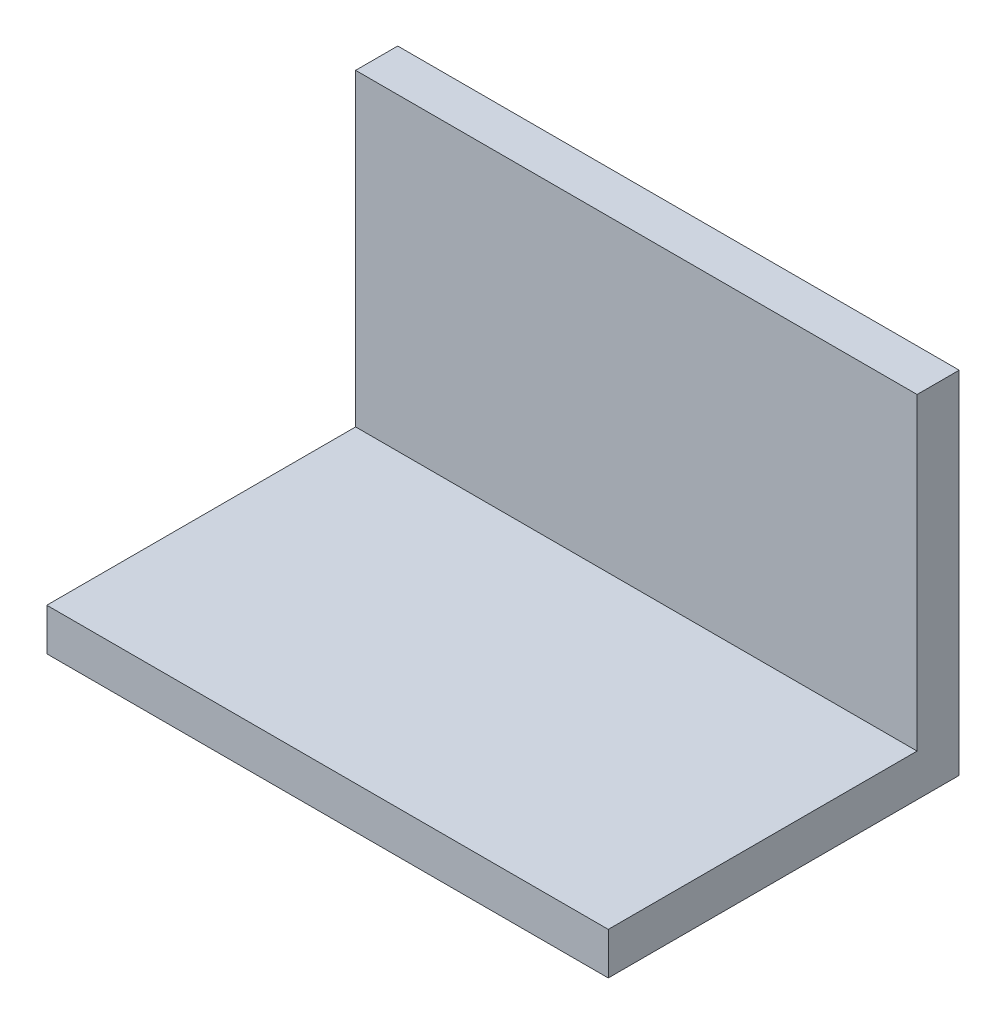
ISO-10303-21;
HEADER;
FILE_DESCRIPTION(('STEP AP214'),'2;1');
FILE_NAME('part.step','',(''),(''),'','','');
FILE_SCHEMA(('AUTOMOTIVE_DESIGN { 1 0 10303 214 1 1 1 1 }'));
ENDSEC;
DATA;
#1=APPLICATION_CONTEXT('core data for automotive mechanical design processes');
#2=APPLICATION_PROTOCOL_DEFINITION('international standard','automotive_design',2000,#1);
#3=PRODUCT_CONTEXT('',#1,'mechanical');
#4=PRODUCT('Part','Part','',(#3));
#5=PRODUCT_RELATED_PRODUCT_CATEGORY('part','',(#4));
#6=PRODUCT_DEFINITION_FORMATION('','',#4);
#7=PRODUCT_DEFINITION_CONTEXT('part definition',#1,'design');
#8=PRODUCT_DEFINITION('design','',#6,#7);
#9=PRODUCT_DEFINITION_SHAPE('','',#8);
#10=(LENGTH_UNIT() NAMED_UNIT(*) SI_UNIT(.MILLI.,.METRE.));
#11=(NAMED_UNIT(*) PLANE_ANGLE_UNIT() SI_UNIT($,.RADIAN.));
#12=(NAMED_UNIT(*) SI_UNIT($,.STERADIAN.) SOLID_ANGLE_UNIT());
#13=UNCERTAINTY_MEASURE_WITH_UNIT(LENGTH_MEASURE(1.E-05),#10,'distance_accuracy_value','');
#14=(GEOMETRIC_REPRESENTATION_CONTEXT(3) GLOBAL_UNCERTAINTY_ASSIGNED_CONTEXT((#13)) GLOBAL_UNIT_ASSIGNED_CONTEXT((#10,
#11,#12)) REPRESENTATION_CONTEXT('',''));
#15=CARTESIAN_POINT('',(0.,0.,0.));
#16=DIRECTION('',(0.,0.,1.));
#17=DIRECTION('',(1.,0.,0.));
#18=AXIS2_PLACEMENT_3D('',#15,#16,#17);
#19=CARTESIAN_POINT('',(0.,6.,0.));
#20=DIRECTION('',(0.,-1.,0.));
#21=DIRECTION('',(0.,0.,-1.));
#22=AXIS2_PLACEMENT_3D('',#19,#20,#21);
#23=PLANE('',#22);
#24=DIRECTION('',(1.,0.,0.));
#25=VECTOR('',#24,1.);
#26=CARTESIAN_POINT('',(-40.,6.,-19.));
#27=LINE('',#26,#25);
#28=CARTESIAN_POINT('',(-40.,6.,-19.));
#29=VERTEX_POINT('',#28);
#30=CARTESIAN_POINT('',(40.,6.,-19.));
#31=VERTEX_POINT('',#30);
#32=EDGE_CURVE('E50',#29,#31,#27,.T.);
#33=ORIENTED_EDGE('',*,*,#32,.F.);
#34=DIRECTION('',(0.,0.,1.));
#35=VECTOR('',#34,1.);
#36=CARTESIAN_POINT('',(-40.,6.,25.));
#37=LINE('',#36,#35);
#38=CARTESIAN_POINT('',(-40.,6.,25.));
#39=VERTEX_POINT('',#38);
#40=EDGE_CURVE('E110',#29,#39,#37,.T.);
#41=ORIENTED_EDGE('',*,*,#40,.T.);
#42=DIRECTION('',(1.,0.,0.));
#43=VECTOR('',#42,1.);
#44=CARTESIAN_POINT('',(-40.,6.,25.));
#45=LINE('',#44,#43);
#46=CARTESIAN_POINT('',(40.,6.,25.));
#47=VERTEX_POINT('',#46);
#48=EDGE_CURVE('E56',#39,#47,#45,.T.);
#49=ORIENTED_EDGE('',*,*,#48,.T.);
#50=DIRECTION('',(0.,0.,-1.));
#51=VECTOR('',#50,1.);
#52=CARTESIAN_POINT('',(40.,6.,25.));
#53=LINE('',#52,#51);
#54=EDGE_CURVE('E85',#47,#31,#53,.T.);
#55=ORIENTED_EDGE('',*,*,#54,.T.);
#56=EDGE_LOOP('',(#33,#41,#49,#55));
#57=FACE_BOUND('',#56,.T.);
#58=ADVANCED_FACE('F33',(#57),#23,.F.);
#59=CARTESIAN_POINT('',(40.,6.,25.));
#60=DIRECTION('',(-1.,0.,0.));
#61=DIRECTION('',(0.,0.,1.));
#62=AXIS2_PLACEMENT_3D('',#59,#60,#61);
#63=PLANE('',#62);
#64=DIRECTION('',(0.,0.,-1.));
#65=VECTOR('',#64,1.);
#66=CARTESIAN_POINT('',(40.,0.,25.));
#67=LINE('',#66,#65);
#68=CARTESIAN_POINT('',(40.,0.,25.));
#69=VERTEX_POINT('',#68);
#70=CARTESIAN_POINT('',(40.,0.,-25.));
#71=VERTEX_POINT('',#70);
#72=EDGE_CURVE('E91',#69,#71,#67,.T.);
#73=ORIENTED_EDGE('',*,*,#72,.T.);
#74=DIRECTION('',(0.,-1.,0.));
#75=VECTOR('',#74,1.);
#76=CARTESIAN_POINT('',(40.,6.,-25.));
#77=LINE('',#76,#75);
#78=CARTESIAN_POINT('',(40.,50.,-25.));
#79=VERTEX_POINT('',#78);
#80=EDGE_CURVE('E11',#79,#71,#77,.T.);
#81=ORIENTED_EDGE('',*,*,#80,.F.);
#82=DIRECTION('',(0.,0.,-1.));
#83=VECTOR('',#82,1.);
#84=CARTESIAN_POINT('',(40.,50.,-19.));
#85=LINE('',#84,#83);
#86=CARTESIAN_POINT('',(40.,50.,-19.));
#87=VERTEX_POINT('',#86);
#88=EDGE_CURVE('E127',#87,#79,#85,.T.);
#89=ORIENTED_EDGE('',*,*,#88,.F.);
#90=DIRECTION('',(0.,-1.,0.));
#91=VECTOR('',#90,1.);
#92=CARTESIAN_POINT('',(40.,50.,-19.));
#93=LINE('',#92,#91);
#94=EDGE_CURVE('E100',#87,#31,#93,.T.);
#95=ORIENTED_EDGE('',*,*,#94,.T.);
#96=ORIENTED_EDGE('',*,*,#54,.F.);
#97=DIRECTION('',(0.,-1.,0.));
#98=VECTOR('',#97,1.);
#99=CARTESIAN_POINT('',(40.,6.,25.));
#100=LINE('',#99,#98);
#101=EDGE_CURVE('E78',#47,#69,#100,.T.);
#102=ORIENTED_EDGE('',*,*,#101,.T.);
#103=EDGE_LOOP('',(#73,#81,#89,#95,#96,#102));
#104=FACE_BOUND('',#103,.T.);
#105=ADVANCED_FACE('F35',(#104),#63,.F.);
#106=CARTESIAN_POINT('',(-40.,6.,-25.));
#107=DIRECTION('',(0.,0.,1.));
#108=DIRECTION('',(1.,0.,0.));
#109=AXIS2_PLACEMENT_3D('',#106,#107,#108);
#110=PLANE('',#109);
#111=DIRECTION('',(-1.,0.,0.));
#112=VECTOR('',#111,1.);
#113=CARTESIAN_POINT('',(-40.,0.,-25.));
#114=LINE('',#113,#112);
#115=CARTESIAN_POINT('',(-40.,0.,-25.));
#116=VERTEX_POINT('',#115);
#117=EDGE_CURVE('E95',#71,#116,#114,.T.);
#118=ORIENTED_EDGE('',*,*,#117,.T.);
#119=DIRECTION('',(0.,-1.,0.));
#120=VECTOR('',#119,1.);
#121=CARTESIAN_POINT('',(-40.,6.,-25.));
#122=LINE('',#121,#120);
#123=CARTESIAN_POINT('',(-40.,50.,-25.));
#124=VERTEX_POINT('',#123);
#125=EDGE_CURVE('E42',#124,#116,#122,.T.);
#126=ORIENTED_EDGE('',*,*,#125,.F.);
#127=DIRECTION('',(-1.,0.,0.));
#128=VECTOR('',#127,1.);
#129=CARTESIAN_POINT('',(-40.,50.,-25.));
#130=LINE('',#129,#128);
#131=EDGE_CURVE('E117',#79,#124,#130,.T.);
#132=ORIENTED_EDGE('',*,*,#131,.F.);
#133=ORIENTED_EDGE('',*,*,#80,.T.);
#134=EDGE_LOOP('',(#118,#126,#132,#133));
#135=FACE_BOUND('',#134,.T.);
#136=ADVANCED_FACE('F151',(#135),#110,.F.);
#137=CARTESIAN_POINT('',(-40.,6.,25.));
#138=DIRECTION('',(1.,0.,0.));
#139=DIRECTION('',(0.,0.,-1.));
#140=AXIS2_PLACEMENT_3D('',#137,#138,#139);
#141=PLANE('',#140);
#142=DIRECTION('',(0.,0.,1.));
#143=VECTOR('',#142,1.);
#144=CARTESIAN_POINT('',(-40.,0.,25.));
#145=LINE('',#144,#143);
#146=CARTESIAN_POINT('',(-40.,0.,25.));
#147=VERTEX_POINT('',#146);
#148=EDGE_CURVE('E86',#116,#147,#145,.T.);
#149=ORIENTED_EDGE('',*,*,#148,.T.);
#150=DIRECTION('',(0.,-1.,0.));
#151=VECTOR('',#150,1.);
#152=CARTESIAN_POINT('',(-40.,6.,25.));
#153=LINE('',#152,#151);
#154=EDGE_CURVE('E81',#39,#147,#153,.T.);
#155=ORIENTED_EDGE('',*,*,#154,.F.);
#156=ORIENTED_EDGE('',*,*,#40,.F.);
#157=DIRECTION('',(0.,-1.,0.));
#158=VECTOR('',#157,1.);
#159=CARTESIAN_POINT('',(-40.,50.,-19.));
#160=LINE('',#159,#158);
#161=CARTESIAN_POINT('',(-40.,50.,-19.));
#162=VERTEX_POINT('',#161);
#163=EDGE_CURVE('E96',#162,#29,#160,.T.);
#164=ORIENTED_EDGE('',*,*,#163,.F.);
#165=DIRECTION('',(0.,0.,1.));
#166=VECTOR('',#165,1.);
#167=CARTESIAN_POINT('',(-40.,50.,-19.));
#168=LINE('',#167,#166);
#169=EDGE_CURVE('E120',#124,#162,#168,.T.);
#170=ORIENTED_EDGE('',*,*,#169,.F.);
#171=ORIENTED_EDGE('',*,*,#125,.T.);
#172=EDGE_LOOP('',(#149,#155,#156,#164,#170,#171));
#173=FACE_BOUND('',#172,.T.);
#174=ADVANCED_FACE('F145',(#173),#141,.F.);
#175=CARTESIAN_POINT('',(-40.,6.,25.));
#176=DIRECTION('',(0.,0.,-1.));
#177=DIRECTION('',(-1.,0.,0.));
#178=AXIS2_PLACEMENT_3D('',#175,#176,#177);
#179=PLANE('',#178);
#180=DIRECTION('',(1.,0.,0.));
#181=VECTOR('',#180,1.);
#182=CARTESIAN_POINT('',(-40.,0.,25.));
#183=LINE('',#182,#181);
#184=EDGE_CURVE('E75',#147,#69,#183,.T.);
#185=ORIENTED_EDGE('',*,*,#184,.T.);
#186=ORIENTED_EDGE('',*,*,#101,.F.);
#187=ORIENTED_EDGE('',*,*,#48,.F.);
#188=ORIENTED_EDGE('',*,*,#154,.T.);
#189=EDGE_LOOP('',(#185,#186,#187,#188));
#190=FACE_BOUND('',#189,.T.);
#191=ADVANCED_FACE('F77',(#190),#179,.F.);
#192=CARTESIAN_POINT('',(0.,0.,0.));
#193=DIRECTION('',(0.,-1.,0.));
#194=DIRECTION('',(0.,0.,-1.));
#195=AXIS2_PLACEMENT_3D('',#192,#193,#194);
#196=PLANE('',#195);
#197=ORIENTED_EDGE('',*,*,#72,.F.);
#198=ORIENTED_EDGE('',*,*,#184,.F.);
#199=ORIENTED_EDGE('',*,*,#148,.F.);
#200=ORIENTED_EDGE('',*,*,#117,.F.);
#201=EDGE_LOOP('',(#197,#198,#199,#200));
#202=FACE_BOUND('',#201,.T.);
#203=ADVANCED_FACE('F94',(#202),#196,.T.);
#204=CARTESIAN_POINT('',(-40.,50.,-19.));
#205=DIRECTION('',(0.,0.,-1.));
#206=DIRECTION('',(-1.,0.,0.));
#207=AXIS2_PLACEMENT_3D('',#204,#205,#206);
#208=PLANE('',#207);
#209=ORIENTED_EDGE('',*,*,#32,.T.);
#210=ORIENTED_EDGE('',*,*,#94,.F.);
#211=DIRECTION('',(1.,0.,0.));
#212=VECTOR('',#211,1.);
#213=CARTESIAN_POINT('',(-40.,50.,-19.));
#214=LINE('',#213,#212);
#215=EDGE_CURVE('E133',#162,#87,#214,.T.);
#216=ORIENTED_EDGE('',*,*,#215,.F.);
#217=ORIENTED_EDGE('',*,*,#163,.T.);
#218=EDGE_LOOP('',(#209,#210,#216,#217));
#219=FACE_BOUND('',#218,.T.);
#220=ADVANCED_FACE('F147',(#219),#208,.F.);
#221=CARTESIAN_POINT('',(0.,50.,0.));
#222=DIRECTION('',(0.,-1.,0.));
#223=DIRECTION('',(0.,0.,-1.));
#224=AXIS2_PLACEMENT_3D('',#221,#222,#223);
#225=PLANE('',#224);
#226=ORIENTED_EDGE('',*,*,#169,.T.);
#227=ORIENTED_EDGE('',*,*,#215,.T.);
#228=ORIENTED_EDGE('',*,*,#88,.T.);
#229=ORIENTED_EDGE('',*,*,#131,.T.);
#230=EDGE_LOOP('',(#226,#227,#228,#229));
#231=FACE_BOUND('',#230,.T.);
#232=ADVANCED_FACE('F140',(#231),#225,.F.);
#233=CLOSED_SHELL('',(#58,#105,#136,#174,#191,#203,#220,#232));
#234=MANIFOLD_SOLID_BREP('B2',#233);
#235=ADVANCED_BREP_SHAPE_REPRESENTATION('',(#18,#234),#14);
#236=SHAPE_DEFINITION_REPRESENTATION(#9,#235);
ENDSEC;
END-ISO-10303-21;
